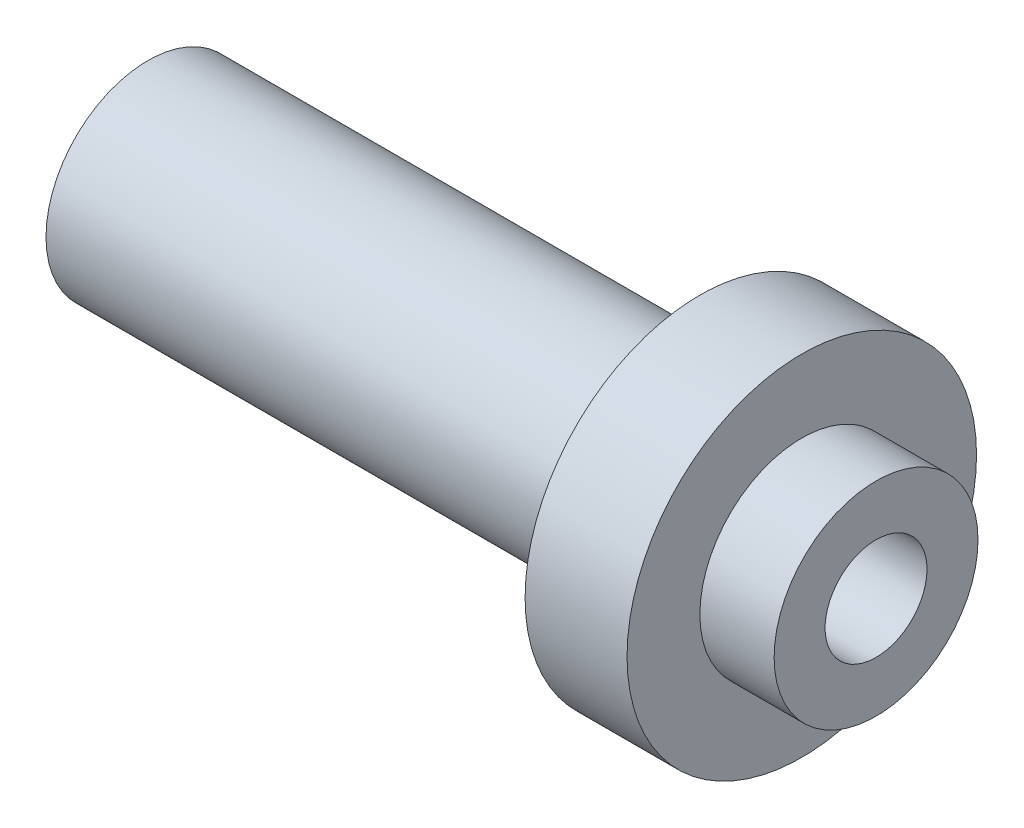
ISO-10303-21;
HEADER;
FILE_DESCRIPTION(('STEP AP214'),'2;1');
FILE_NAME('part.step','',(''),(''),'','','');
FILE_SCHEMA(('AUTOMOTIVE_DESIGN { 1 0 10303 214 1 1 1 1 }'));
ENDSEC;
DATA;
#1=APPLICATION_CONTEXT('core data for automotive mechanical design processes');
#2=APPLICATION_PROTOCOL_DEFINITION('international standard','automotive_design',2000,#1);
#3=PRODUCT_CONTEXT('',#1,'mechanical');
#4=PRODUCT('Part','Part','',(#3));
#5=PRODUCT_RELATED_PRODUCT_CATEGORY('part','',(#4));
#6=PRODUCT_DEFINITION_FORMATION('','',#4);
#7=PRODUCT_DEFINITION_CONTEXT('part definition',#1,'design');
#8=PRODUCT_DEFINITION('design','',#6,#7);
#9=PRODUCT_DEFINITION_SHAPE('','',#8);
#10=(LENGTH_UNIT() NAMED_UNIT(*) SI_UNIT(.MILLI.,.METRE.));
#11=(NAMED_UNIT(*) PLANE_ANGLE_UNIT() SI_UNIT($,.RADIAN.));
#12=(NAMED_UNIT(*) SI_UNIT($,.STERADIAN.) SOLID_ANGLE_UNIT());
#13=UNCERTAINTY_MEASURE_WITH_UNIT(LENGTH_MEASURE(1.E-05),#10,'distance_accuracy_value','');
#14=(GEOMETRIC_REPRESENTATION_CONTEXT(3) GLOBAL_UNCERTAINTY_ASSIGNED_CONTEXT((#13)) GLOBAL_UNIT_ASSIGNED_CONTEXT((#10,
#11,#12)) REPRESENTATION_CONTEXT('',''));
#15=CARTESIAN_POINT('',(0.,0.,0.));
#16=DIRECTION('',(0.,0.,1.));
#17=DIRECTION('',(1.,0.,0.));
#18=AXIS2_PLACEMENT_3D('',#15,#16,#17);
#19=CARTESIAN_POINT('',(-78.343949044586,0.,0.));
#20=DIRECTION('',(-1.,0.,0.));
#21=DIRECTION('',(0.,0.,1.));
#22=AXIS2_PLACEMENT_3D('',#19,#20,#21);
#23=CYLINDRICAL_SURFACE('',#22,12.);
#24=CARTESIAN_POINT('',(-12.1,0.,0.));
#25=DIRECTION('',(-1.,0.,0.));
#26=DIRECTION('',(0.,0.,1.));
#27=AXIS2_PLACEMENT_3D('',#24,#25,#26);
#28=CIRCLE('',#27,12.);
#29=CARTESIAN_POINT('',(-12.1,0.,12.));
#30=VERTEX_POINT('',#29);
#31=EDGE_CURVE('E11',#30,#30,#28,.T.);
#32=ORIENTED_EDGE('',*,*,#31,.F.);
#33=EDGE_LOOP('',(#32));
#34=FACE_BOUND('',#33,.T.);
#35=CARTESIAN_POINT('',(-5.10000000000001,0.,0.));
#36=DIRECTION('',(-1.,0.,0.));
#37=DIRECTION('',(0.,0.,1.));
#38=AXIS2_PLACEMENT_3D('',#35,#36,#37);
#39=CIRCLE('',#38,12.);
#40=CARTESIAN_POINT('',(-5.10000000000001,0.,12.));
#41=VERTEX_POINT('',#40);
#42=EDGE_CURVE('E55',#41,#41,#39,.T.);
#43=ORIENTED_EDGE('',*,*,#42,.T.);
#44=EDGE_LOOP('',(#43));
#45=FACE_BOUND('',#44,.T.);
#46=ADVANCED_FACE('F36',(#34,#45),#23,.T.);
#47=CARTESIAN_POINT('',(-12.1,12.,0.));
#48=DIRECTION('',(1.,0.,0.));
#49=DIRECTION('',(0.,0.,-1.));
#50=AXIS2_PLACEMENT_3D('',#47,#48,#49);
#51=PLANE('',#50);
#52=CARTESIAN_POINT('',(-12.1,0.,0.));
#53=DIRECTION('',(-1.,0.,0.));
#54=DIRECTION('',(0.,0.,1.));
#55=AXIS2_PLACEMENT_3D('',#52,#53,#54);
#56=CIRCLE('',#55,7.);
#57=CARTESIAN_POINT('',(-12.1,0.,7.));
#58=VERTEX_POINT('',#57);
#59=EDGE_CURVE('E42',#58,#58,#56,.T.);
#60=ORIENTED_EDGE('',*,*,#59,.F.);
#61=EDGE_LOOP('',(#60));
#62=FACE_BOUND('',#61,.T.);
#63=ORIENTED_EDGE('',*,*,#31,.T.);
#64=EDGE_LOOP('',(#63));
#65=FACE_BOUND('',#64,.T.);
#66=ADVANCED_FACE('F76',(#62,#65),#51,.F.);
#67=CARTESIAN_POINT('',(-78.343949044586,0.,0.));
#68=DIRECTION('',(-1.,0.,0.));
#69=DIRECTION('',(0.,0.,1.));
#70=AXIS2_PLACEMENT_3D('',#67,#68,#69);
#71=CYLINDRICAL_SURFACE('',#70,7.00000000000001);
#72=CARTESIAN_POINT('',(-50.,0.,0.));
#73=DIRECTION('',(-1.,0.,0.));
#74=DIRECTION('',(0.,0.,1.));
#75=AXIS2_PLACEMENT_3D('',#72,#73,#74);
#76=CIRCLE('',#75,7.00000000000001);
#77=CARTESIAN_POINT('',(-50.,0.,7.00000000000001));
#78=VERTEX_POINT('',#77);
#79=EDGE_CURVE('E69',#78,#78,#76,.T.);
#80=ORIENTED_EDGE('',*,*,#79,.F.);
#81=EDGE_LOOP('',(#80));
#82=FACE_BOUND('',#81,.T.);
#83=ORIENTED_EDGE('',*,*,#59,.T.);
#84=EDGE_LOOP('',(#83));
#85=FACE_BOUND('',#84,.T.);
#86=ADVANCED_FACE('F74',(#82,#85),#71,.T.);
#87=CARTESIAN_POINT('',(-50.,7.00000000000001,0.));
#88=DIRECTION('',(1.,0.,0.));
#89=DIRECTION('',(0.,0.,-1.));
#90=AXIS2_PLACEMENT_3D('',#87,#88,#89);
#91=PLANE('',#90);
#92=ORIENTED_EDGE('',*,*,#79,.T.);
#93=EDGE_LOOP('',(#92));
#94=FACE_BOUND('',#93,.T.);
#95=ADVANCED_FACE('F98',(#94),#91,.F.);
#96=CARTESIAN_POINT('',(0.,7.,0.));
#97=DIRECTION('',(-1.,0.,0.));
#98=DIRECTION('',(0.,0.,1.));
#99=AXIS2_PLACEMENT_3D('',#96,#97,#98);
#100=PLANE('',#99);
#101=CARTESIAN_POINT('',(0.,0.,0.));
#102=DIRECTION('',(1.,0.,0.));
#103=DIRECTION('',(0.,0.,-1.));
#104=AXIS2_PLACEMENT_3D('',#101,#102,#103);
#105=CIRCLE('',#104,3.49999999999999);
#106=CARTESIAN_POINT('',(0.,0.,-3.49999999999999));
#107=VERTEX_POINT('',#106);
#108=EDGE_CURVE('E56',#107,#107,#105,.T.);
#109=ORIENTED_EDGE('',*,*,#108,.F.);
#110=EDGE_LOOP('',(#109));
#111=FACE_BOUND('',#110,.T.);
#112=CARTESIAN_POINT('',(0.,0.,0.));
#113=DIRECTION('',(-1.,0.,0.));
#114=DIRECTION('',(0.,0.,1.));
#115=AXIS2_PLACEMENT_3D('',#112,#113,#114);
#116=CIRCLE('',#115,7.);
#117=CARTESIAN_POINT('',(0.,0.,7.));
#118=VERTEX_POINT('',#117);
#119=EDGE_CURVE('E66',#118,#118,#116,.T.);
#120=ORIENTED_EDGE('',*,*,#119,.F.);
#121=EDGE_LOOP('',(#120));
#122=FACE_BOUND('',#121,.T.);
#123=ADVANCED_FACE('F93',(#111,#122),#100,.F.);
#124=CARTESIAN_POINT('',(-78.343949044586,0.,0.));
#125=DIRECTION('',(-1.,0.,0.));
#126=DIRECTION('',(0.,0.,1.));
#127=AXIS2_PLACEMENT_3D('',#124,#125,#126);
#128=CYLINDRICAL_SURFACE('',#127,7.);
#129=CARTESIAN_POINT('',(-5.09999999999999,0.,0.));
#130=DIRECTION('',(-1.,0.,0.));
#131=DIRECTION('',(0.,0.,1.));
#132=AXIS2_PLACEMENT_3D('',#129,#130,#131);
#133=CIRCLE('',#132,7.);
#134=CARTESIAN_POINT('',(-5.09999999999999,0.,7.));
#135=VERTEX_POINT('',#134);
#136=EDGE_CURVE('E59',#135,#135,#133,.T.);
#137=ORIENTED_EDGE('',*,*,#136,.F.);
#138=EDGE_LOOP('',(#137));
#139=FACE_BOUND('',#138,.T.);
#140=ORIENTED_EDGE('',*,*,#119,.T.);
#141=EDGE_LOOP('',(#140));
#142=FACE_BOUND('',#141,.T.);
#143=ADVANCED_FACE('F87',(#139,#142),#128,.T.);
#144=CARTESIAN_POINT('',(-5.1,12.,0.));
#145=DIRECTION('',(-1.,0.,0.));
#146=DIRECTION('',(0.,0.,1.));
#147=AXIS2_PLACEMENT_3D('',#144,#145,#146);
#148=PLANE('',#147);
#149=ORIENTED_EDGE('',*,*,#42,.F.);
#150=EDGE_LOOP('',(#149));
#151=FACE_BOUND('',#150,.T.);
#152=ORIENTED_EDGE('',*,*,#136,.T.);
#153=EDGE_LOOP('',(#152));
#154=FACE_BOUND('',#153,.T.);
#155=ADVANCED_FACE('F49',(#151,#154),#148,.F.);
#156=CARTESIAN_POINT('',(-30.,0.,0.));
#157=DIRECTION('',(1.,0.,0.));
#158=DIRECTION('',(0.,0.,-1.));
#159=AXIS2_PLACEMENT_3D('',#156,#157,#158);
#160=CONICAL_SURFACE('',#159,3.49999999999999,1.02974425867665);
#161=CARTESIAN_POINT('',(-32.1030121665965,0.,0.));
#162=VERTEX_POINT('',#161);
#163=VERTEX_LOOP('',#162);
#164=FACE_BOUND('',#163,.T.);
#165=CARTESIAN_POINT('',(-30.,0.,0.));
#166=DIRECTION('',(1.,0.,0.));
#167=DIRECTION('',(0.,0.,-1.));
#168=AXIS2_PLACEMENT_3D('',#165,#166,#167);
#169=CIRCLE('',#168,3.49999999999999);
#170=CARTESIAN_POINT('',(-30.,0.,-3.49999999999999));
#171=VERTEX_POINT('',#170);
#172=EDGE_CURVE('E53',#171,#171,#169,.T.);
#173=ORIENTED_EDGE('',*,*,#172,.T.);
#174=EDGE_LOOP('',(#173));
#175=FACE_BOUND('',#174,.T.);
#176=ADVANCED_FACE('F45',(#164,#175),#160,.F.);
#177=CARTESIAN_POINT('',(0.,0.,0.));
#178=DIRECTION('',(1.,0.,0.));
#179=DIRECTION('',(0.,0.,-1.));
#180=AXIS2_PLACEMENT_3D('',#177,#178,#179);
#181=CYLINDRICAL_SURFACE('',#180,3.49999999999999);
#182=ORIENTED_EDGE('',*,*,#172,.F.);
#183=EDGE_LOOP('',(#182));
#184=FACE_BOUND('',#183,.T.);
#185=ORIENTED_EDGE('',*,*,#108,.T.);
#186=EDGE_LOOP('',(#185));
#187=FACE_BOUND('',#186,.T.);
#188=ADVANCED_FACE('F48',(#184,#187),#181,.F.);
#189=CLOSED_SHELL('',(#46,#66,#86,#95,#123,#143,#155,#176,#188));
#190=MANIFOLD_SOLID_BREP('B2',#189);
#191=ADVANCED_BREP_SHAPE_REPRESENTATION('',(#18,#190),#14);
#192=SHAPE_DEFINITION_REPRESENTATION(#9,#191);
ENDSEC;
END-ISO-10303-21;
